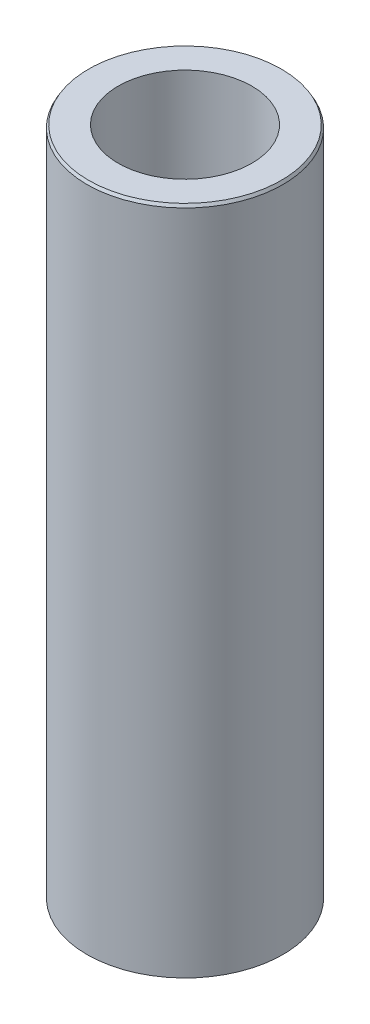
ISO-10303-21;
HEADER;
FILE_DESCRIPTION(('STEP AP214'),'2;1');
FILE_NAME('part.step','',(''),(''),'','','');
FILE_SCHEMA(('AUTOMOTIVE_DESIGN { 1 0 10303 214 1 1 1 1 }'));
ENDSEC;
DATA;
#1=APPLICATION_CONTEXT('core data for automotive mechanical design processes');
#2=APPLICATION_PROTOCOL_DEFINITION('international standard','automotive_design',2000,#1);
#3=PRODUCT_CONTEXT('',#1,'mechanical');
#4=PRODUCT('Part','Part','',(#3));
#5=PRODUCT_RELATED_PRODUCT_CATEGORY('part','',(#4));
#6=PRODUCT_DEFINITION_FORMATION('','',#4);
#7=PRODUCT_DEFINITION_CONTEXT('part definition',#1,'design');
#8=PRODUCT_DEFINITION('design','',#6,#7);
#9=PRODUCT_DEFINITION_SHAPE('','',#8);
#10=(LENGTH_UNIT() NAMED_UNIT(*) SI_UNIT(.MILLI.,.METRE.));
#11=(NAMED_UNIT(*) PLANE_ANGLE_UNIT() SI_UNIT($,.RADIAN.));
#12=(NAMED_UNIT(*) SI_UNIT($,.STERADIAN.) SOLID_ANGLE_UNIT());
#13=UNCERTAINTY_MEASURE_WITH_UNIT(LENGTH_MEASURE(1.E-05),#10,'distance_accuracy_value','');
#14=(GEOMETRIC_REPRESENTATION_CONTEXT(3) GLOBAL_UNCERTAINTY_ASSIGNED_CONTEXT((#13)) GLOBAL_UNIT_ASSIGNED_CONTEXT((#10,
#11,#12)) REPRESENTATION_CONTEXT('',''));
#15=CARTESIAN_POINT('',(0.,0.,0.));
#16=DIRECTION('',(0.,0.,1.));
#17=DIRECTION('',(1.,0.,0.));
#18=AXIS2_PLACEMENT_3D('',#15,#16,#17);
#19=CARTESIAN_POINT('',(0.,239.682260127511,0.));
#20=DIRECTION('',(0.,-1.,0.));
#21=DIRECTION('',(0.,0.,-1.));
#22=AXIS2_PLACEMENT_3D('',#19,#20,#21);
#23=CYLINDRICAL_SURFACE('',#22,35.);
#24=CARTESIAN_POINT('',(0.,238.667788900005,0.));
#25=DIRECTION('',(0.,1.,0.));
#26=DIRECTION('',(0.,0.,1.));
#27=AXIS2_PLACEMENT_3D('',#24,#25,#26);
#28=CIRCLE('',#27,35.);
#29=CARTESIAN_POINT('',(0.,238.667788900005,-35.));
#30=VERTEX_POINT('',#29);
#31=EDGE_CURVE('E50',#30,#30,#28,.F.);
#32=CARTESIAN_POINT('',(0.,0.585705236285788,0.));
#33=DIRECTION('',(0.,1.,0.));
#34=DIRECTION('',(0.,0.,1.));
#35=AXIS2_PLACEMENT_3D('',#32,#33,#34);
#36=CIRCLE('',#35,35.);
#37=CARTESIAN_POINT('',(0.,0.585705236285788,-35.));
#38=VERTEX_POINT('',#37);
#39=EDGE_CURVE('E51',#38,#38,#36,.T.);
#40=CARTESIAN_POINT('',(0.,238.667788900005,-35.));
#41=CARTESIAN_POINT('',(0.,236.187767195175,-35.));
#42=CARTESIAN_POINT('',(0.,233.707745490344,-35.));
#43=CARTESIAN_POINT('',(0.,228.747702080683,-35.));
#44=CARTESIAN_POINT('',(0.,226.267680375853,-35.));
#45=CARTESIAN_POINT('',(0.,221.307636966192,-35.));
#46=CARTESIAN_POINT('',(0.,218.827615261362,-35.));
#47=CARTESIAN_POINT('',(0.,213.867571851701,-35.));
#48=CARTESIAN_POINT('',(0.,211.387550146871,-35.));
#49=CARTESIAN_POINT('',(0.,206.42750673721,-35.));
#50=CARTESIAN_POINT('',(0.,203.947485032379,-35.));
#51=CARTESIAN_POINT('',(0.,198.987441622718,-35.));
#52=CARTESIAN_POINT('',(0.,196.507419917888,-35.));
#53=CARTESIAN_POINT('',(0.,191.547376508227,-35.));
#54=CARTESIAN_POINT('',(0.,189.067354803397,-35.));
#55=CARTESIAN_POINT('',(0.,184.107311393736,-35.));
#56=CARTESIAN_POINT('',(0.,181.627289688906,-35.));
#57=CARTESIAN_POINT('',(0.,176.667246279245,-35.));
#58=CARTESIAN_POINT('',(0.,174.187224574414,-35.));
#59=CARTESIAN_POINT('',(0.,169.227181164754,-35.));
#60=CARTESIAN_POINT('',(0.,166.747159459923,-35.));
#61=CARTESIAN_POINT('',(0.,161.787116050262,-35.));
#62=CARTESIAN_POINT('',(0.,159.307094345432,-35.));
#63=CARTESIAN_POINT('',(0.,154.347050935771,-35.));
#64=CARTESIAN_POINT('',(0.,151.867029230941,-35.));
#65=CARTESIAN_POINT('',(0.,146.90698582128,-35.));
#66=CARTESIAN_POINT('',(0.,144.42696411645,-35.));
#67=CARTESIAN_POINT('',(0.,139.466920706789,-35.));
#68=CARTESIAN_POINT('',(0.,136.986899001958,-35.));
#69=CARTESIAN_POINT('',(0.,132.026855592297,-35.));
#70=CARTESIAN_POINT('',(0.,129.546833887467,-35.));
#71=CARTESIAN_POINT('',(0.,124.586790477806,-35.));
#72=CARTESIAN_POINT('',(0.,122.106768772976,-35.));
#73=CARTESIAN_POINT('',(0.,117.146725363315,-35.));
#74=CARTESIAN_POINT('',(0.,114.666703658485,-35.));
#75=CARTESIAN_POINT('',(0.,109.706660248824,-35.));
#76=CARTESIAN_POINT('',(0.,107.226638543993,-35.));
#77=CARTESIAN_POINT('',(0.,102.266595134333,-35.));
#78=CARTESIAN_POINT('',(0.,99.7865734295022,-35.));
#79=CARTESIAN_POINT('',(0.,94.8265300198413,-35.));
#80=CARTESIAN_POINT('',(0.,92.3465083150109,-35.));
#81=CARTESIAN_POINT('',(0.,87.3864649053501,-35.));
#82=CARTESIAN_POINT('',(0.,84.9064432005197,-35.));
#83=CARTESIAN_POINT('',(0.,79.9463997908589,-35.));
#84=CARTESIAN_POINT('',(0.,77.4663780860285,-35.));
#85=CARTESIAN_POINT('',(0.,72.5063346763677,-35.));
#86=CARTESIAN_POINT('',(0.,70.0263129715373,-35.));
#87=CARTESIAN_POINT('',(0.,65.0662695618764,-35.));
#88=CARTESIAN_POINT('',(0.,62.586247857046,-35.));
#89=CARTESIAN_POINT('',(0.,57.6262044473852,-35.));
#90=CARTESIAN_POINT('',(0.,55.1461827425548,-35.));
#91=CARTESIAN_POINT('',(0.,50.186139332894,-35.));
#92=CARTESIAN_POINT('',(0.,47.7061176280636,-35.));
#93=CARTESIAN_POINT('',(0.,42.7460742184028,-35.));
#94=CARTESIAN_POINT('',(0.,40.2660525135724,-35.));
#95=CARTESIAN_POINT('',(0.,35.3060091039115,-35.));
#96=CARTESIAN_POINT('',(0.,32.8259873990811,-35.));
#97=CARTESIAN_POINT('',(0.,27.8659439894203,-35.));
#98=CARTESIAN_POINT('',(0.,25.3859222845899,-35.));
#99=CARTESIAN_POINT('',(0.,20.4258788749291,-35.));
#100=CARTESIAN_POINT('',(0.,17.9458571700987,-35.));
#101=CARTESIAN_POINT('',(0.,12.9858137604379,-35.));
#102=CARTESIAN_POINT('',(0.,10.5057920556074,-35.));
#103=CARTESIAN_POINT('',(0.,5.54574864594662,-35.));
#104=CARTESIAN_POINT('',(0.,3.06572694111621,-35.));
#105=CARTESIAN_POINT('',(0.,0.585705236285788,-35.));
#106=B_SPLINE_CURVE_WITH_KNOTS('',3,(#40,#41,#42,#43,#44,#45,#46,#47,#48,#49,#50,#51,#52,#53,
#54,#55,#56,#57,#58,#59,#60,#61,#62,#63,#64,#65,#66,#67,#68,#69,#70,#71,#72,#73,#74,#75,#76,#77,
#78,#79,#80,#81,#82,#83,#84,#85,#86,#87,#88,#89,#90,#91,#92,#93,#94,#95,#96,#97,#98,#99,#100,
#101,#102,#103,#104,#105),.UNSPECIFIED.,.F.,.F.,(4,2,2,2,2,2,2,2,2,2,2,2,2,2,2,2,2,2,2,2,2,2,2,
2,2,2,2,2,2,2,2,2,4),(0.,7.44006511449125,14.8801302289825,22.3201953434737,29.7602604579649,
37.2003255724561,44.6403906869474,52.0804558014386,59.5205209159298,66.960586030421,
74.4006511449123,81.8407162594035,89.2807813738947,96.7208464883859,104.160911602877,
111.600976717368,119.04104183186,126.481106946351,133.921172060842,141.361237175333,
148.801302289825,156.241367404316,163.681432518807,171.121497633298,178.561562747789,
186.001627862281,193.441692976772,200.881758091263,208.321823205754,215.761888320246,
223.201953434737,230.642018549228,238.082083663719),.UNSPECIFIED.);
#107=EDGE_CURVE('BSEAM39',#30,#38,#106,.T.);
#108=ORIENTED_EDGE('',*,*,#31,.T.);
#109=ORIENTED_EDGE('',*,*,#39,.T.);
#110=ORIENTED_EDGE('',*,*,#107,.T.);
#111=ORIENTED_EDGE('',*,*,#107,.F.);
#112=EDGE_LOOP('',(#108,#110,#109,#111));
#113=FACE_BOUND('',#112,.T.);
#114=ADVANCED_FACE('F39',(#113),#23,.T.);
#115=CARTESIAN_POINT('',(0.,239.682260127511,0.));
#116=DIRECTION('',(0.,1.,0.));
#117=DIRECTION('',(0.,0.,1.));
#118=AXIS2_PLACEMENT_3D('',#115,#116,#117);
#119=PLANE('',#118);
#120=CARTESIAN_POINT('',(0.,239.682260127511,0.));
#121=DIRECTION('',(0.,1.,0.));
#122=DIRECTION('',(0.,0.,1.));
#123=AXIS2_PLACEMENT_3D('',#120,#121,#122);
#124=CIRCLE('',#123,34.4142947637144);
#125=CARTESIAN_POINT('',(0.,239.682260127511,34.4142947637144));
#126=VERTEX_POINT('',#125);
#127=EDGE_CURVE('E54',#126,#126,#124,.T.);
#128=ORIENTED_EDGE('',*,*,#127,.T.);
#129=EDGE_LOOP('',(#128));
#130=FACE_BOUND('',#129,.T.);
#131=CARTESIAN_POINT('',(0.,239.682260127511,0.));
#132=DIRECTION('',(0.,1.,0.));
#133=DIRECTION('',(0.,0.,1.));
#134=AXIS2_PLACEMENT_3D('',#131,#132,#133);
#135=CIRCLE('',#134,23.8770964688369);
#136=CARTESIAN_POINT('',(0.,239.682260127511,-23.8770964688369));
#137=VERTEX_POINT('',#136);
#138=EDGE_CURVE('E58',#137,#137,#135,.T.);
#139=ORIENTED_EDGE('',*,*,#138,.F.);
#140=EDGE_LOOP('',(#139));
#141=FACE_BOUND('',#140,.T.);
#142=ADVANCED_FACE('F69',(#130,#141),#119,.T.);
#143=CARTESIAN_POINT('',(0.,0.,0.));
#144=DIRECTION('',(0.,1.,0.));
#145=DIRECTION('',(0.,0.,1.));
#146=AXIS2_PLACEMENT_3D('',#143,#144,#145);
#147=PLANE('',#146);
#148=CARTESIAN_POINT('',(0.,0.,0.));
#149=DIRECTION('',(0.,1.,0.));
#150=DIRECTION('',(0.,0.,1.));
#151=AXIS2_PLACEMENT_3D('',#148,#149,#150);
#152=CIRCLE('',#151,33.9855287724939);
#153=CARTESIAN_POINT('',(0.,0.,33.9855287724939));
#154=VERTEX_POINT('',#153);
#155=EDGE_CURVE('E10',#154,#154,#152,.F.);
#156=ORIENTED_EDGE('',*,*,#155,.T.);
#157=EDGE_LOOP('',(#156));
#158=FACE_BOUND('',#157,.T.);
#159=CARTESIAN_POINT('',(0.,0.,0.));
#160=DIRECTION('',(0.,1.,0.));
#161=DIRECTION('',(0.,0.,1.));
#162=AXIS2_PLACEMENT_3D('',#159,#160,#161);
#163=CIRCLE('',#162,23.8770964688369);
#164=CARTESIAN_POINT('',(0.,0.,-23.8770964688369));
#165=VERTEX_POINT('',#164);
#166=EDGE_CURVE('E63',#165,#165,#163,.T.);
#167=ORIENTED_EDGE('',*,*,#166,.T.);
#168=EDGE_LOOP('',(#167));
#169=FACE_BOUND('',#168,.T.);
#170=ADVANCED_FACE('F75',(#158,#169),#147,.F.);
#171=CARTESIAN_POINT('',(0.,239.682260127511,0.));
#172=DIRECTION('',(0.,-1.,0.));
#173=DIRECTION('',(0.,0.,-1.));
#174=AXIS2_PLACEMENT_3D('',#171,#172,#173);
#175=CYLINDRICAL_SURFACE('',#174,23.8770964688369);
#176=CARTESIAN_POINT('',(0.,239.682260127511,-23.8770964688369));
#177=CARTESIAN_POINT('',(0.,237.185569917849,-23.8770964688369));
#178=CARTESIAN_POINT('',(0.,234.688879708188,-23.8770964688369));
#179=CARTESIAN_POINT('',(0.,229.695499288865,-23.8770964688369));
#180=CARTESIAN_POINT('',(0.,227.198809079203,-23.8770964688369));
#181=CARTESIAN_POINT('',(0.,222.20542865988,-23.8770964688369));
#182=CARTESIAN_POINT('',(0.,219.708738450218,-23.8770964688369));
#183=CARTESIAN_POINT('',(0.,214.715358030895,-23.8770964688369));
#184=CARTESIAN_POINT('',(0.,212.218667821234,-23.8770964688369));
#185=CARTESIAN_POINT('',(0.,207.22528740191,-23.8770964688369));
#186=CARTESIAN_POINT('',(0.,204.728597192249,-23.8770964688369));
#187=CARTESIAN_POINT('',(0.,199.735216772926,-23.8770964688369));
#188=CARTESIAN_POINT('',(0.,197.238526563264,-23.8770964688369));
#189=CARTESIAN_POINT('',(0.,192.245146143941,-23.8770964688369));
#190=CARTESIAN_POINT('',(0.,189.748455934279,-23.8770964688369));
#191=CARTESIAN_POINT('',(0.,184.755075514956,-23.8770964688369));
#192=CARTESIAN_POINT('',(0.,182.258385305295,-23.8770964688369));
#193=CARTESIAN_POINT('',(0.,177.265004885972,-23.8770964688369));
#194=CARTESIAN_POINT('',(0.,174.76831467631,-23.8770964688369));
#195=CARTESIAN_POINT('',(0.,169.774934256987,-23.8770964688369));
#196=CARTESIAN_POINT('',(0.,167.278244047325,-23.8770964688369));
#197=CARTESIAN_POINT('',(0.,162.284863628002,-23.8770964688369));
#198=CARTESIAN_POINT('',(0.,159.788173418341,-23.8770964688369));
#199=CARTESIAN_POINT('',(0.,154.794792999017,-23.8770964688369));
#200=CARTESIAN_POINT('',(0.,152.298102789356,-23.8770964688369));
#201=CARTESIAN_POINT('',(0.,147.304722370033,-23.8770964688369));
#202=CARTESIAN_POINT('',(0.,144.808032160371,-23.8770964688369));
#203=CARTESIAN_POINT('',(0.,139.814651741048,-23.8770964688369));
#204=CARTESIAN_POINT('',(0.,137.317961531386,-23.8770964688369));
#205=CARTESIAN_POINT('',(0.,132.324581112063,-23.8770964688369));
#206=CARTESIAN_POINT('',(0.,129.827890902402,-23.8770964688369));
#207=CARTESIAN_POINT('',(0.,124.834510483079,-23.8770964688369));
#208=CARTESIAN_POINT('',(0.,122.337820273417,-23.8770964688369));
#209=CARTESIAN_POINT('',(0.,117.344439854094,-23.8770964688369));
#210=CARTESIAN_POINT('',(0.,114.847749644432,-23.8770964688369));
#211=CARTESIAN_POINT('',(0.,109.854369225109,-23.8770964688369));
#212=CARTESIAN_POINT('',(0.,107.357679015448,-23.8770964688369));
#213=CARTESIAN_POINT('',(0.,102.364298596124,-23.8770964688369));
#214=CARTESIAN_POINT('',(0.,99.8676083864629,-23.8770964688369));
#215=CARTESIAN_POINT('',(0.,94.8742279671397,-23.8770964688369));
#216=CARTESIAN_POINT('',(0.,92.3775377574782,-23.8770964688369));
#217=CARTESIAN_POINT('',(0.,87.384157338155,-23.8770964688369));
#218=CARTESIAN_POINT('',(0.,84.8874671284934,-23.8770964688369));
#219=CARTESIAN_POINT('',(0.,79.8940867091703,-23.8770964688369));
#220=CARTESIAN_POINT('',(0.,77.3973964995087,-23.8770964688369));
#221=CARTESIAN_POINT('',(0.,72.4040160801856,-23.8770964688369));
#222=CARTESIAN_POINT('',(0.,69.907325870524,-23.8770964688369));
#223=CARTESIAN_POINT('',(0.,64.9139454512008,-23.8770964688369));
#224=CARTESIAN_POINT('',(0.,62.4172552415393,-23.8770964688369));
#225=CARTESIAN_POINT('',(0.,57.4238748222161,-23.8770964688369));
#226=CARTESIAN_POINT('',(0.,54.9271846125546,-23.8770964688369));
#227=CARTESIAN_POINT('',(0.,49.9338041932314,-23.8770964688369));
#228=CARTESIAN_POINT('',(0.,47.4371139835698,-23.8770964688369));
#229=CARTESIAN_POINT('',(0.,42.4437335642467,-23.8770964688369));
#230=CARTESIAN_POINT('',(0.,39.9470433545851,-23.8770964688369));
#231=CARTESIAN_POINT('',(0.,34.953662935262,-23.8770964688369));
#232=CARTESIAN_POINT('',(0.,32.4569727256004,-23.8770964688369));
#233=CARTESIAN_POINT('',(0.,27.4635923062773,-23.8770964688369));
#234=CARTESIAN_POINT('',(0.,24.9669020966157,-23.8770964688369));
#235=CARTESIAN_POINT('',(0.,19.9735216772925,-23.8770964688369));
#236=CARTESIAN_POINT('',(0.,17.476831467631,-23.8770964688369));
#237=CARTESIAN_POINT('',(0.,12.4834510483078,-23.8770964688369));
#238=CARTESIAN_POINT('',(0.,9.98676083864625,-23.8770964688369));
#239=CARTESIAN_POINT('',(0.,4.99338041932312,-23.8770964688369));
#240=CARTESIAN_POINT('',(0.,2.49669020966154,-23.8770964688369));
#241=CARTESIAN_POINT('',(0.,0.,-23.8770964688369));
#242=B_SPLINE_CURVE_WITH_KNOTS('',3,(#176,#177,#178,#179,#180,#181,#182,#183,#184,#185,#186,
#187,#188,#189,#190,#191,#192,#193,#194,#195,#196,#197,#198,#199,#200,#201,#202,#203,#204,#205,
#206,#207,#208,#209,#210,#211,#212,#213,#214,#215,#216,#217,#218,#219,#220,#221,#222,#223,#224,
#225,#226,#227,#228,#229,#230,#231,#232,#233,#234,#235,#236,#237,#238,#239,#240,#241),
.UNSPECIFIED.,.F.,.F.,(4,2,2,2,2,2,2,2,2,2,2,2,2,2,2,2,2,2,2,2,2,2,2,2,2,2,2,2,2,2,2,2,4),(0.,
7.49007062898474,14.9801412579695,22.4702118869542,29.9602825159389,37.4503531449236,
44.9404237739083,52.430494402893,59.9205650318777,67.4106356608624,74.9007062898472,
82.3907769188319,89.8808475478166,97.3709181768013,104.860988805786,112.351059434771,
119.841130063755,127.33120069274,134.821271321725,142.31134195071,149.801412579694,
157.291483208679,164.781553837664,172.271624466648,179.761695095633,187.251765724618,
194.741836353603,202.231906982587,209.721977611572,217.212048240557,224.702118869541,
232.192189498526,239.682260127511),.UNSPECIFIED.);
#243=EDGE_CURVE('BSEAM70',#137,#165,#242,.T.);
#244=ORIENTED_EDGE('',*,*,#138,.T.);
#245=ORIENTED_EDGE('',*,*,#166,.F.);
#246=ORIENTED_EDGE('',*,*,#243,.T.);
#247=ORIENTED_EDGE('',*,*,#243,.F.);
#248=EDGE_LOOP('',(#244,#246,#245,#247));
#249=FACE_BOUND('',#248,.T.);
#250=ADVANCED_FACE('F70',(#249),#175,.F.);
#251=CARTESIAN_POINT('',(0.,239.682260127511,0.));
#252=DIRECTION('',(0.,-1.,0.));
#253=DIRECTION('',(0.,0.,-1.));
#254=AXIS2_PLACEMENT_3D('',#251,#252,#253);
#255=CONICAL_SURFACE('',#254,34.4142947637144,0.523598775598286);
#256=ORIENTED_EDGE('',*,*,#31,.F.);
#257=EDGE_LOOP('',(#256));
#258=FACE_BOUND('',#257,.T.);
#259=ORIENTED_EDGE('',*,*,#127,.F.);
#260=EDGE_LOOP('',(#259));
#261=FACE_BOUND('',#260,.T.);
#262=ADVANCED_FACE('F81',(#258,#261),#255,.T.);
#263=CARTESIAN_POINT('',(0.,0.585705236285788,0.));
#264=DIRECTION('',(0.,1.,0.));
#265=DIRECTION('',(0.,0.,1.));
#266=AXIS2_PLACEMENT_3D('',#263,#264,#265);
#267=CONICAL_SURFACE('',#266,35.,1.04719755119659);
#268=ORIENTED_EDGE('',*,*,#155,.F.);
#269=EDGE_LOOP('',(#268));
#270=FACE_BOUND('',#269,.T.);
#271=ORIENTED_EDGE('',*,*,#39,.F.);
#272=EDGE_LOOP('',(#271));
#273=FACE_BOUND('',#272,.T.);
#274=ADVANCED_FACE('F45',(#270,#273),#267,.T.);
#275=CLOSED_SHELL('',(#114,#142,#170,#250,#262,#274));
#276=MANIFOLD_SOLID_BREP('B2',#275);
#277=ADVANCED_BREP_SHAPE_REPRESENTATION('',(#18,#276),#14);
#278=SHAPE_DEFINITION_REPRESENTATION(#9,#277);
ENDSEC;
END-ISO-10303-21;
